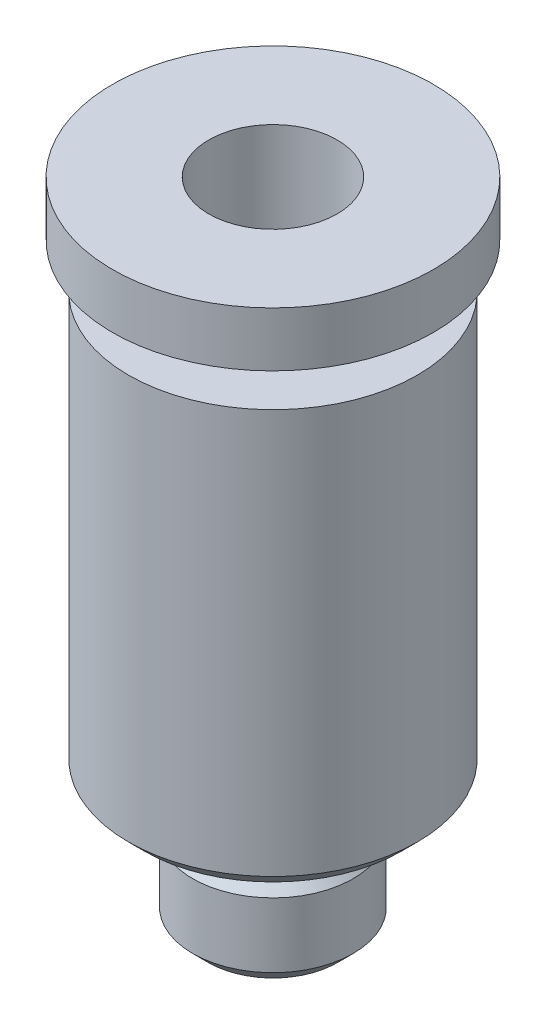
ISO-10303-21;
HEADER;
FILE_DESCRIPTION(('STEP AP214'),'2;1');
FILE_NAME('part.step','',(''),(''),'','','');
FILE_SCHEMA(('AUTOMOTIVE_DESIGN { 1 0 10303 214 1 1 1 1 }'));
ENDSEC;
DATA;
#1=APPLICATION_CONTEXT('core data for automotive mechanical design processes');
#2=APPLICATION_PROTOCOL_DEFINITION('international standard','automotive_design',2000,#1);
#3=PRODUCT_CONTEXT('',#1,'mechanical');
#4=PRODUCT('Part','Part','',(#3));
#5=PRODUCT_RELATED_PRODUCT_CATEGORY('part','',(#4));
#6=PRODUCT_DEFINITION_FORMATION('','',#4);
#7=PRODUCT_DEFINITION_CONTEXT('part definition',#1,'design');
#8=PRODUCT_DEFINITION('design','',#6,#7);
#9=PRODUCT_DEFINITION_SHAPE('','',#8);
#10=(LENGTH_UNIT() NAMED_UNIT(*) SI_UNIT(.MILLI.,.METRE.));
#11=(NAMED_UNIT(*) PLANE_ANGLE_UNIT() SI_UNIT($,.RADIAN.));
#12=(NAMED_UNIT(*) SI_UNIT($,.STERADIAN.) SOLID_ANGLE_UNIT());
#13=UNCERTAINTY_MEASURE_WITH_UNIT(LENGTH_MEASURE(1.E-05),#10,'distance_accuracy_value','');
#14=(GEOMETRIC_REPRESENTATION_CONTEXT(3) GLOBAL_UNCERTAINTY_ASSIGNED_CONTEXT((#13)) GLOBAL_UNIT_ASSIGNED_CONTEXT((#10,
#11,#12)) REPRESENTATION_CONTEXT('',''));
#15=CARTESIAN_POINT('',(0.,0.,0.));
#16=DIRECTION('',(0.,0.,1.));
#17=DIRECTION('',(1.,0.,0.));
#18=AXIS2_PLACEMENT_3D('',#15,#16,#17);
#19=CARTESIAN_POINT('',(0.,4.5,0.));
#20=DIRECTION('',(0.,-1.,0.));
#21=DIRECTION('',(0.,0.,-1.));
#22=AXIS2_PLACEMENT_3D('',#19,#20,#21);
#23=CYLINDRICAL_SURFACE('',#22,4.5);
#24=CARTESIAN_POINT('',(0.,4.5,0.));
#25=DIRECTION('',(0.,-1.,0.));
#26=DIRECTION('',(0.,0.,1.));
#27=AXIS2_PLACEMENT_3D('',#24,#25,#26);
#28=CIRCLE('',#27,4.5);
#29=CARTESIAN_POINT('',(0.,4.5,4.5));
#30=VERTEX_POINT('',#29);
#31=EDGE_CURVE('E32',#30,#30,#28,.T.);
#32=ORIENTED_EDGE('',*,*,#31,.F.);
#33=EDGE_LOOP('',(#32));
#34=FACE_BOUND('',#33,.T.);
#35=CARTESIAN_POINT('',(0.,17.1,0.));
#36=DIRECTION('',(0.,-1.,0.));
#37=DIRECTION('',(0.,0.,-1.));
#38=AXIS2_PLACEMENT_3D('',#35,#36,#37);
#39=CIRCLE('',#38,4.5);
#40=CARTESIAN_POINT('',(0.,17.1,-4.5));
#41=VERTEX_POINT('',#40);
#42=EDGE_CURVE('E17',#41,#41,#39,.F.);
#43=ORIENTED_EDGE('',*,*,#42,.F.);
#44=EDGE_LOOP('',(#43));
#45=FACE_BOUND('',#44,.T.);
#46=ADVANCED_FACE('F14',(#34,#45),#23,.T.);
#47=CARTESIAN_POINT('',(0.,4.,0.));
#48=DIRECTION('',(0.,1.,0.));
#49=DIRECTION('',(0.,0.,1.));
#50=AXIS2_PLACEMENT_3D('',#47,#48,#49);
#51=CONICAL_SURFACE('',#50,4.,0.785398163397448);
#52=ORIENTED_EDGE('',*,*,#31,.T.);
#53=EDGE_LOOP('',(#52));
#54=FACE_BOUND('',#53,.T.);
#55=CARTESIAN_POINT('',(0.,4.,0.));
#56=DIRECTION('',(0.,1.,0.));
#57=DIRECTION('',(0.,0.,1.));
#58=AXIS2_PLACEMENT_3D('',#55,#56,#57);
#59=CIRCLE('',#58,4.);
#60=CARTESIAN_POINT('',(0.,4.,4.));
#61=VERTEX_POINT('',#60);
#62=EDGE_CURVE('E69',#61,#61,#59,.F.);
#63=ORIENTED_EDGE('',*,*,#62,.F.);
#64=EDGE_LOOP('',(#63));
#65=FACE_BOUND('',#64,.T.);
#66=ADVANCED_FACE('F82',(#54,#65),#51,.T.);
#67=CARTESIAN_POINT('',(-4.55400000000001,17.1,-4.554));
#68=DIRECTION('',(0.,1.,0.));
#69=DIRECTION('',(0.,0.,1.));
#70=AXIS2_PLACEMENT_3D('',#67,#68,#69);
#71=PLANE('',#70);
#72=CARTESIAN_POINT('',(0.,17.1,0.));
#73=DIRECTION('',(0.,-1.,0.));
#74=DIRECTION('',(0.,0.,-1.));
#75=AXIS2_PLACEMENT_3D('',#72,#73,#74);
#76=CIRCLE('',#75,2.55);
#77=CARTESIAN_POINT('',(0.,17.1,-2.55));
#78=VERTEX_POINT('',#77);
#79=EDGE_CURVE('E66',#78,#78,#76,.F.);
#80=ORIENTED_EDGE('',*,*,#79,.F.);
#81=EDGE_LOOP('',(#80));
#82=FACE_BOUND('',#81,.T.);
#83=ORIENTED_EDGE('',*,*,#42,.T.);
#84=EDGE_LOOP('',(#83));
#85=FACE_BOUND('',#84,.T.);
#86=ADVANCED_FACE('F91',(#82,#85),#71,.T.);
#87=CARTESIAN_POINT('',(-4.04800000000001,4.,4.048));
#88=DIRECTION('',(0.,-1.,0.));
#89=DIRECTION('',(0.,0.,-1.));
#90=AXIS2_PLACEMENT_3D('',#87,#88,#89);
#91=PLANE('',#90);
#92=CARTESIAN_POINT('',(0.,4.,0.));
#93=DIRECTION('',(0.,-1.,0.));
#94=DIRECTION('',(0.,0.,-1.));
#95=AXIS2_PLACEMENT_3D('',#92,#93,#94);
#96=CIRCLE('',#95,2.9);
#97=CARTESIAN_POINT('',(0.,4.,-2.9));
#98=VERTEX_POINT('',#97);
#99=EDGE_CURVE('E62',#98,#98,#96,.T.);
#100=ORIENTED_EDGE('',*,*,#99,.F.);
#101=EDGE_LOOP('',(#100));
#102=FACE_BOUND('',#101,.T.);
#103=ORIENTED_EDGE('',*,*,#62,.T.);
#104=EDGE_LOOP('',(#103));
#105=FACE_BOUND('',#104,.T.);
#106=ADVANCED_FACE('F156',(#102,#105),#91,.T.);
#107=CARTESIAN_POINT('',(0.,17.1,0.));
#108=DIRECTION('',(0.,-1.,0.));
#109=DIRECTION('',(0.,0.,-1.));
#110=AXIS2_PLACEMENT_3D('',#107,#108,#109);
#111=CYLINDRICAL_SURFACE('',#110,2.55);
#112=ORIENTED_EDGE('',*,*,#79,.T.);
#113=EDGE_LOOP('',(#112));
#114=FACE_BOUND('',#113,.T.);
#115=CARTESIAN_POINT('',(0.,18.5,0.));
#116=DIRECTION('',(0.,-1.,0.));
#117=DIRECTION('',(0.,0.,-1.));
#118=AXIS2_PLACEMENT_3D('',#115,#116,#117);
#119=CIRCLE('',#118,2.55);
#120=CARTESIAN_POINT('',(0.,18.5,-2.55));
#121=VERTEX_POINT('',#120);
#122=EDGE_CURVE('E58',#121,#121,#119,.F.);
#123=ORIENTED_EDGE('',*,*,#122,.F.);
#124=EDGE_LOOP('',(#123));
#125=FACE_BOUND('',#124,.T.);
#126=ADVANCED_FACE('F143',(#114,#125),#111,.T.);
#127=CARTESIAN_POINT('',(0.,4.,0.));
#128=DIRECTION('',(0.,-1.,0.));
#129=DIRECTION('',(0.,0.,-1.));
#130=AXIS2_PLACEMENT_3D('',#127,#128,#129);
#131=TOROIDAL_SURFACE('',#130,2.4,0.5);
#132=CARTESIAN_POINT('',(0.,4.,0.));
#133=DIRECTION('',(0.,-1.,0.));
#134=DIRECTION('',(0.,0.,-1.));
#135=AXIS2_PLACEMENT_3D('',#132,#133,#134);
#136=CIRCLE('',#135,1.9);
#137=CARTESIAN_POINT('',(0.,4.,-1.9));
#138=VERTEX_POINT('',#137);
#139=EDGE_CURVE('E57',#138,#138,#136,.T.);
#140=ORIENTED_EDGE('',*,*,#139,.F.);
#141=EDGE_LOOP('',(#140));
#142=FACE_BOUND('',#141,.T.);
#143=ORIENTED_EDGE('',*,*,#99,.T.);
#144=EDGE_LOOP('',(#143));
#145=FACE_BOUND('',#144,.T.);
#146=ADVANCED_FACE('F138',(#142,#145),#131,.T.);
#147=CARTESIAN_POINT('',(-5.06000000000001,18.5,5.06));
#148=DIRECTION('',(0.,-1.,0.));
#149=DIRECTION('',(0.,0.,-1.));
#150=AXIS2_PLACEMENT_3D('',#147,#148,#149);
#151=PLANE('',#150);
#152=ORIENTED_EDGE('',*,*,#122,.T.);
#153=EDGE_LOOP('',(#152));
#154=FACE_BOUND('',#153,.T.);
#155=CARTESIAN_POINT('',(0.,18.5,0.));
#156=DIRECTION('',(0.,-1.,0.));
#157=DIRECTION('',(1.,0.,0.));
#158=AXIS2_PLACEMENT_3D('',#155,#156,#157);
#159=CIRCLE('',#158,5.);
#160=CARTESIAN_POINT('',(5.,18.5,0.));
#161=VERTEX_POINT('',#160);
#162=EDGE_CURVE('E53',#161,#161,#159,.F.);
#163=ORIENTED_EDGE('',*,*,#162,.F.);
#164=EDGE_LOOP('',(#163));
#165=FACE_BOUND('',#164,.T.);
#166=ADVANCED_FACE('F134',(#154,#165),#151,.T.);
#167=CARTESIAN_POINT('',(0.,3.1095,0.));
#168=DIRECTION('',(0.,-1.,0.));
#169=DIRECTION('',(0.,0.,-1.));
#170=AXIS2_PLACEMENT_3D('',#167,#168,#169);
#171=CYLINDRICAL_SURFACE('',#170,1.9);
#172=CARTESIAN_POINT('',(0.,3.1095,0.));
#173=DIRECTION('',(0.,1.,0.));
#174=DIRECTION('',(0.,0.,-1.));
#175=AXIS2_PLACEMENT_3D('',#172,#173,#174);
#176=CIRCLE('',#175,1.9);
#177=CARTESIAN_POINT('',(0.,3.1095,-1.9));
#178=VERTEX_POINT('',#177);
#179=EDGE_CURVE('E52',#178,#178,#176,.F.);
#180=ORIENTED_EDGE('',*,*,#179,.F.);
#181=EDGE_LOOP('',(#180));
#182=FACE_BOUND('',#181,.T.);
#183=ORIENTED_EDGE('',*,*,#139,.T.);
#184=EDGE_LOOP('',(#183));
#185=FACE_BOUND('',#184,.T.);
#186=ADVANCED_FACE('F130',(#182,#185),#171,.T.);
#187=CARTESIAN_POINT('',(0.,18.5,0.));
#188=DIRECTION('',(0.,-1.,0.));
#189=DIRECTION('',(1.,0.,0.));
#190=AXIS2_PLACEMENT_3D('',#187,#188,#189);
#191=CYLINDRICAL_SURFACE('',#190,5.);
#192=ORIENTED_EDGE('',*,*,#162,.T.);
#193=EDGE_LOOP('',(#192));
#194=FACE_BOUND('',#193,.T.);
#195=CARTESIAN_POINT('',(0.,20.2,0.));
#196=DIRECTION('',(0.,-1.,0.));
#197=DIRECTION('',(1.,0.,0.));
#198=AXIS2_PLACEMENT_3D('',#195,#196,#197);
#199=CIRCLE('',#198,5.);
#200=CARTESIAN_POINT('',(5.,20.2,0.));
#201=VERTEX_POINT('',#200);
#202=EDGE_CURVE('E48',#201,#201,#199,.F.);
#203=ORIENTED_EDGE('',*,*,#202,.F.);
#204=EDGE_LOOP('',(#203));
#205=FACE_BOUND('',#204,.T.);
#206=ADVANCED_FACE('F126',(#194,#205),#191,.T.);
#207=CARTESIAN_POINT('',(0.,3.1095,0.));
#208=DIRECTION('',(0.,-1.,0.));
#209=DIRECTION('',(0.,0.,-1.));
#210=AXIS2_PLACEMENT_3D('',#207,#208,#209);
#211=CONICAL_SURFACE('',#210,1.9,0.785398163397448);
#212=CARTESIAN_POINT('',(0.,2.5095,0.));
#213=DIRECTION('',(0.,-1.,0.));
#214=DIRECTION('',(0.,0.,-1.));
#215=AXIS2_PLACEMENT_3D('',#212,#213,#214);
#216=CIRCLE('',#215,2.5);
#217=CARTESIAN_POINT('',(0.,2.5095,-2.5));
#218=VERTEX_POINT('',#217);
#219=EDGE_CURVE('E47',#218,#218,#216,.T.);
#220=ORIENTED_EDGE('',*,*,#219,.F.);
#221=EDGE_LOOP('',(#220));
#222=FACE_BOUND('',#221,.T.);
#223=ORIENTED_EDGE('',*,*,#179,.T.);
#224=EDGE_LOOP('',(#223));
#225=FACE_BOUND('',#224,.T.);
#226=ADVANCED_FACE('F122',(#222,#225),#211,.T.);
#227=CARTESIAN_POINT('',(-5.06000000000001,20.2,-5.06));
#228=DIRECTION('',(0.,1.,0.));
#229=DIRECTION('',(0.,0.,1.));
#230=AXIS2_PLACEMENT_3D('',#227,#228,#229);
#231=PLANE('',#230);
#232=CARTESIAN_POINT('',(0.,20.2,0.));
#233=DIRECTION('',(0.,-1.,0.));
#234=DIRECTION('',(1.,0.,0.));
#235=AXIS2_PLACEMENT_3D('',#232,#233,#234);
#236=CIRCLE('',#235,2.);
#237=CARTESIAN_POINT('',(2.,20.2,0.));
#238=VERTEX_POINT('',#237);
#239=EDGE_CURVE('E43',#238,#238,#236,.F.);
#240=ORIENTED_EDGE('',*,*,#239,.F.);
#241=EDGE_LOOP('',(#240));
#242=FACE_BOUND('',#241,.T.);
#243=ORIENTED_EDGE('',*,*,#202,.T.);
#244=EDGE_LOOP('',(#243));
#245=FACE_BOUND('',#244,.T.);
#246=ADVANCED_FACE('F118',(#242,#245),#231,.T.);
#247=CARTESIAN_POINT('',(0.,0.4905,0.));
#248=DIRECTION('',(0.,-1.,0.));
#249=DIRECTION('',(0.,0.,-1.));
#250=AXIS2_PLACEMENT_3D('',#247,#248,#249);
#251=CYLINDRICAL_SURFACE('',#250,2.5);
#252=CARTESIAN_POINT('',(0.,0.4905,0.));
#253=DIRECTION('',(0.,-1.,0.));
#254=DIRECTION('',(0.,0.,1.));
#255=AXIS2_PLACEMENT_3D('',#252,#253,#254);
#256=CIRCLE('',#255,2.5);
#257=CARTESIAN_POINT('',(0.,0.4905,2.5));
#258=VERTEX_POINT('',#257);
#259=EDGE_CURVE('E42',#258,#258,#256,.T.);
#260=ORIENTED_EDGE('',*,*,#259,.F.);
#261=EDGE_LOOP('',(#260));
#262=FACE_BOUND('',#261,.T.);
#263=ORIENTED_EDGE('',*,*,#219,.T.);
#264=EDGE_LOOP('',(#263));
#265=FACE_BOUND('',#264,.T.);
#266=ADVANCED_FACE('F114',(#262,#265),#251,.T.);
#267=CARTESIAN_POINT('',(0.,20.2,0.));
#268=DIRECTION('',(0.,-1.,0.));
#269=DIRECTION('',(1.,0.,0.));
#270=AXIS2_PLACEMENT_3D('',#267,#268,#269);
#271=CYLINDRICAL_SURFACE('',#270,2.);
#272=CARTESIAN_POINT('',(0.,10.2,0.));
#273=DIRECTION('',(0.,-1.,0.));
#274=DIRECTION('',(1.,0.,0.));
#275=AXIS2_PLACEMENT_3D('',#272,#273,#274);
#276=CIRCLE('',#275,2.);
#277=CARTESIAN_POINT('',(1.99999999999999,10.2,0.));
#278=VERTEX_POINT('',#277);
#279=EDGE_CURVE('E38',#278,#278,#276,.F.);
#280=ORIENTED_EDGE('',*,*,#279,.F.);
#281=EDGE_LOOP('',(#280));
#282=FACE_BOUND('',#281,.T.);
#283=ORIENTED_EDGE('',*,*,#239,.T.);
#284=EDGE_LOOP('',(#283));
#285=FACE_BOUND('',#284,.T.);
#286=ADVANCED_FACE('F110',(#282,#285),#271,.F.);
#287=CARTESIAN_POINT('',(0.,0.,0.));
#288=DIRECTION('',(0.,1.,0.));
#289=DIRECTION('',(0.,0.,1.));
#290=AXIS2_PLACEMENT_3D('',#287,#288,#289);
#291=CONICAL_SURFACE('',#290,2.0095,0.785398163397448);
#292=ORIENTED_EDGE('',*,*,#259,.T.);
#293=EDGE_LOOP('',(#292));
#294=FACE_BOUND('',#293,.T.);
#295=CARTESIAN_POINT('',(0.,0.,0.));
#296=DIRECTION('',(0.,1.,0.));
#297=DIRECTION('',(0.,0.,1.));
#298=AXIS2_PLACEMENT_3D('',#295,#296,#297);
#299=CIRCLE('',#298,2.0095);
#300=CARTESIAN_POINT('',(0.,0.,2.0095));
#301=VERTEX_POINT('',#300);
#302=EDGE_CURVE('E29',#301,#301,#299,.F.);
#303=ORIENTED_EDGE('',*,*,#302,.F.);
#304=EDGE_LOOP('',(#303));
#305=FACE_BOUND('',#304,.T.);
#306=ADVANCED_FACE('F106',(#294,#305),#291,.T.);
#307=CARTESIAN_POINT('',(-2.024,10.2,-2.024));
#308=DIRECTION('',(0.,1.,0.));
#309=DIRECTION('',(0.,0.,1.));
#310=AXIS2_PLACEMENT_3D('',#307,#308,#309);
#311=PLANE('',#310);
#312=CARTESIAN_POINT('',(0.,10.2,0.));
#313=DIRECTION('',(0.,-1.,0.));
#314=DIRECTION('',(1.,0.,0.));
#315=AXIS2_PLACEMENT_3D('',#312,#313,#314);
#316=CIRCLE('',#315,1.3);
#317=CARTESIAN_POINT('',(1.3,10.2,0.));
#318=VERTEX_POINT('',#317);
#319=EDGE_CURVE('E22',#318,#318,#316,.F.);
#320=ORIENTED_EDGE('',*,*,#319,.F.);
#321=EDGE_LOOP('',(#320));
#322=FACE_BOUND('',#321,.T.);
#323=ORIENTED_EDGE('',*,*,#279,.T.);
#324=EDGE_LOOP('',(#323));
#325=FACE_BOUND('',#324,.T.);
#326=ADVANCED_FACE('F99',(#322,#325),#311,.T.);
#327=CARTESIAN_POINT('',(-2.033614,0.,2.033614));
#328=DIRECTION('',(0.,-1.,0.));
#329=DIRECTION('',(0.,0.,-1.));
#330=AXIS2_PLACEMENT_3D('',#327,#328,#329);
#331=PLANE('',#330);
#332=CARTESIAN_POINT('',(0.,0.,0.));
#333=DIRECTION('',(0.,-1.,0.));
#334=DIRECTION('',(1.,0.,0.));
#335=AXIS2_PLACEMENT_3D('',#332,#333,#334);
#336=CIRCLE('',#335,1.3);
#337=CARTESIAN_POINT('',(1.29999999999999,0.,0.));
#338=VERTEX_POINT('',#337);
#339=EDGE_CURVE('E9',#338,#338,#336,.T.);
#340=ORIENTED_EDGE('',*,*,#339,.F.);
#341=EDGE_LOOP('',(#340));
#342=FACE_BOUND('',#341,.T.);
#343=ORIENTED_EDGE('',*,*,#302,.T.);
#344=EDGE_LOOP('',(#343));
#345=FACE_BOUND('',#344,.T.);
#346=ADVANCED_FACE('F94',(#342,#345),#331,.T.);
#347=CARTESIAN_POINT('',(0.,10.2,0.));
#348=DIRECTION('',(0.,-1.,0.));
#349=DIRECTION('',(1.,0.,0.));
#350=AXIS2_PLACEMENT_3D('',#347,#348,#349);
#351=CYLINDRICAL_SURFACE('',#350,1.3);
#352=ORIENTED_EDGE('',*,*,#339,.T.);
#353=EDGE_LOOP('',(#352));
#354=FACE_BOUND('',#353,.T.);
#355=ORIENTED_EDGE('',*,*,#319,.T.);
#356=EDGE_LOOP('',(#355));
#357=FACE_BOUND('',#356,.T.);
#358=ADVANCED_FACE('F92',(#354,#357),#351,.F.);
#359=CLOSED_SHELL('',(#46,#66,#86,#106,#126,#146,#166,#186,#206,#226,#246,#266,#286,#306,#326,
#346,#358));
#360=MANIFOLD_SOLID_BREP('B1',#359);
#361=ADVANCED_BREP_SHAPE_REPRESENTATION('',(#18,#360),#14);
#362=SHAPE_DEFINITION_REPRESENTATION(#9,#361);
ENDSEC;
END-ISO-10303-21;
